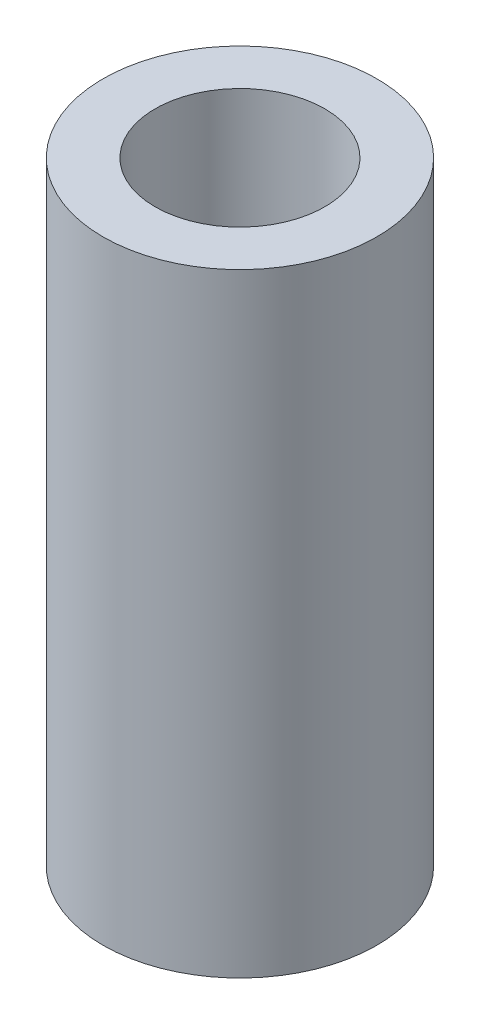
ISO-10303-21;
HEADER;
FILE_DESCRIPTION(('STEP AP214'),'2;1');
FILE_NAME('part.step','',(''),(''),'','','');
FILE_SCHEMA(('AUTOMOTIVE_DESIGN { 1 0 10303 214 1 1 1 1 }'));
ENDSEC;
DATA;
#1=APPLICATION_CONTEXT('core data for automotive mechanical design processes');
#2=APPLICATION_PROTOCOL_DEFINITION('international standard','automotive_design',2000,#1);
#3=PRODUCT_CONTEXT('',#1,'mechanical');
#4=PRODUCT('Part','Part','',(#3));
#5=PRODUCT_RELATED_PRODUCT_CATEGORY('part','',(#4));
#6=PRODUCT_DEFINITION_FORMATION('','',#4);
#7=PRODUCT_DEFINITION_CONTEXT('part definition',#1,'design');
#8=PRODUCT_DEFINITION('design','',#6,#7);
#9=PRODUCT_DEFINITION_SHAPE('','',#8);
#10=(LENGTH_UNIT() NAMED_UNIT(*) SI_UNIT(.MILLI.,.METRE.));
#11=(NAMED_UNIT(*) PLANE_ANGLE_UNIT() SI_UNIT($,.RADIAN.));
#12=(NAMED_UNIT(*) SI_UNIT($,.STERADIAN.) SOLID_ANGLE_UNIT());
#13=UNCERTAINTY_MEASURE_WITH_UNIT(LENGTH_MEASURE(1.E-05),#10,'distance_accuracy_value','');
#14=(GEOMETRIC_REPRESENTATION_CONTEXT(3) GLOBAL_UNCERTAINTY_ASSIGNED_CONTEXT((#13)) GLOBAL_UNIT_ASSIGNED_CONTEXT((#10,
#11,#12)) REPRESENTATION_CONTEXT('',''));
#15=CARTESIAN_POINT('',(0.,0.,0.));
#16=DIRECTION('',(0.,0.,1.));
#17=DIRECTION('',(1.,0.,0.));
#18=AXIS2_PLACEMENT_3D('',#15,#16,#17);
#19=CARTESIAN_POINT('',(0.,56.,0.));
#20=DIRECTION('',(0.,1.,0.));
#21=DIRECTION('',(0.,0.,1.));
#22=AXIS2_PLACEMENT_3D('',#19,#20,#21);
#23=PLANE('',#22);
#24=CARTESIAN_POINT('',(0.,56.,0.));
#25=DIRECTION('',(0.,1.,0.));
#26=DIRECTION('',(0.,0.,1.));
#27=AXIS2_PLACEMENT_3D('',#24,#25,#26);
#28=CIRCLE('',#27,12.5);
#29=CARTESIAN_POINT('',(0.,56.,12.5));
#30=VERTEX_POINT('',#29);
#31=EDGE_CURVE('E10',#30,#30,#28,.T.);
#32=ORIENTED_EDGE('',*,*,#31,.T.);
#33=EDGE_LOOP('',(#32));
#34=FACE_BOUND('',#33,.T.);
#35=CARTESIAN_POINT('',(0.,56.,0.));
#36=DIRECTION('',(0.,1.,0.));
#37=DIRECTION('',(0.,0.,1.));
#38=AXIS2_PLACEMENT_3D('',#35,#36,#37);
#39=CIRCLE('',#38,7.75);
#40=CARTESIAN_POINT('',(0.,56.,7.75));
#41=VERTEX_POINT('',#40);
#42=EDGE_CURVE('E40',#41,#41,#39,.T.);
#43=ORIENTED_EDGE('',*,*,#42,.F.);
#44=EDGE_LOOP('',(#43));
#45=FACE_BOUND('',#44,.T.);
#46=ADVANCED_FACE('F29',(#34,#45),#23,.T.);
#47=CARTESIAN_POINT('',(0.,0.,0.));
#48=DIRECTION('',(0.,1.,0.));
#49=DIRECTION('',(0.,0.,1.));
#50=AXIS2_PLACEMENT_3D('',#47,#48,#49);
#51=PLANE('',#50);
#52=CARTESIAN_POINT('',(0.,0.,0.));
#53=DIRECTION('',(0.,1.,0.));
#54=DIRECTION('',(0.,0.,1.));
#55=AXIS2_PLACEMENT_3D('',#52,#53,#54);
#56=CIRCLE('',#55,12.5);
#57=CARTESIAN_POINT('',(0.,0.,12.5));
#58=VERTEX_POINT('',#57);
#59=EDGE_CURVE('E33',#58,#58,#56,.T.);
#60=ORIENTED_EDGE('',*,*,#59,.F.);
#61=EDGE_LOOP('',(#60));
#62=FACE_BOUND('',#61,.T.);
#63=CARTESIAN_POINT('',(0.,0.,0.));
#64=DIRECTION('',(0.,1.,0.));
#65=DIRECTION('',(0.,0.,1.));
#66=AXIS2_PLACEMENT_3D('',#63,#64,#65);
#67=CIRCLE('',#66,7.75);
#68=CARTESIAN_POINT('',(0.,0.,7.75));
#69=VERTEX_POINT('',#68);
#70=EDGE_CURVE('E42',#69,#69,#67,.T.);
#71=ORIENTED_EDGE('',*,*,#70,.T.);
#72=EDGE_LOOP('',(#71));
#73=FACE_BOUND('',#72,.T.);
#74=ADVANCED_FACE('F52',(#62,#73),#51,.F.);
#75=CARTESIAN_POINT('',(0.,56.,0.));
#76=DIRECTION('',(0.,-1.,0.));
#77=DIRECTION('',(0.,0.,-1.));
#78=AXIS2_PLACEMENT_3D('',#75,#76,#77);
#79=CYLINDRICAL_SURFACE('',#78,12.5);
#80=ORIENTED_EDGE('',*,*,#31,.F.);
#81=EDGE_LOOP('',(#80));
#82=FACE_BOUND('',#81,.T.);
#83=ORIENTED_EDGE('',*,*,#59,.T.);
#84=EDGE_LOOP('',(#83));
#85=FACE_BOUND('',#84,.T.);
#86=ADVANCED_FACE('F31',(#82,#85),#79,.T.);
#87=CARTESIAN_POINT('',(0.,56.,0.));
#88=DIRECTION('',(0.,-1.,0.));
#89=DIRECTION('',(0.,0.,-1.));
#90=AXIS2_PLACEMENT_3D('',#87,#88,#89);
#91=CYLINDRICAL_SURFACE('',#90,7.75);
#92=ORIENTED_EDGE('',*,*,#42,.T.);
#93=EDGE_LOOP('',(#92));
#94=FACE_BOUND('',#93,.T.);
#95=ORIENTED_EDGE('',*,*,#70,.F.);
#96=EDGE_LOOP('',(#95));
#97=FACE_BOUND('',#96,.T.);
#98=ADVANCED_FACE('F48',(#94,#97),#91,.F.);
#99=CLOSED_SHELL('',(#46,#74,#86,#98));
#100=MANIFOLD_SOLID_BREP('B2',#99);
#101=ADVANCED_BREP_SHAPE_REPRESENTATION('',(#18,#100),#14);
#102=SHAPE_DEFINITION_REPRESENTATION(#9,#101);
ENDSEC;
END-ISO-10303-21;
